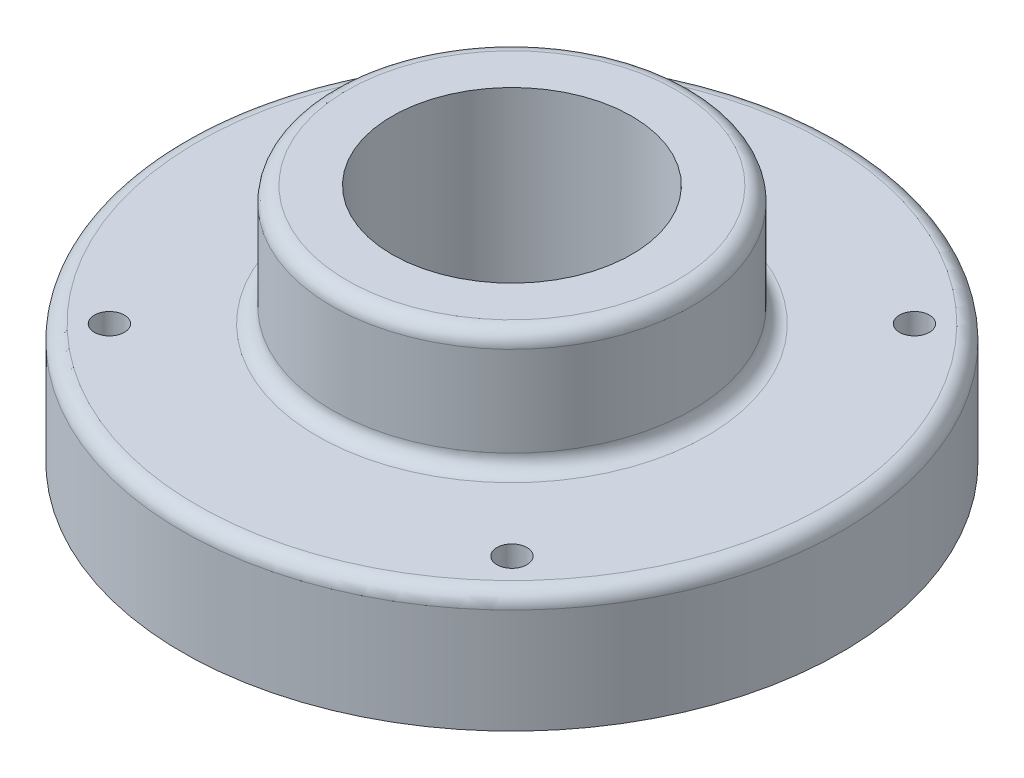
ISO-10303-21;
HEADER;
FILE_DESCRIPTION(('STEP AP214'),'2;1');
FILE_NAME('part.step','',(''),(''),'','','');
FILE_SCHEMA(('AUTOMOTIVE_DESIGN { 1 0 10303 214 1 1 1 1 }'));
ENDSEC;
DATA;
#1=APPLICATION_CONTEXT('core data for automotive mechanical design processes');
#2=APPLICATION_PROTOCOL_DEFINITION('international standard','automotive_design',2000,#1);
#3=PRODUCT_CONTEXT('',#1,'mechanical');
#4=PRODUCT('Part','Part','',(#3));
#5=PRODUCT_RELATED_PRODUCT_CATEGORY('part','',(#4));
#6=PRODUCT_DEFINITION_FORMATION('','',#4);
#7=PRODUCT_DEFINITION_CONTEXT('part definition',#1,'design');
#8=PRODUCT_DEFINITION('design','',#6,#7);
#9=PRODUCT_DEFINITION_SHAPE('','',#8);
#10=(LENGTH_UNIT() NAMED_UNIT(*) SI_UNIT(.MILLI.,.METRE.));
#11=(NAMED_UNIT(*) PLANE_ANGLE_UNIT() SI_UNIT($,.RADIAN.));
#12=(NAMED_UNIT(*) SI_UNIT($,.STERADIAN.) SOLID_ANGLE_UNIT());
#13=UNCERTAINTY_MEASURE_WITH_UNIT(LENGTH_MEASURE(1.E-05),#10,'distance_accuracy_value','');
#14=(GEOMETRIC_REPRESENTATION_CONTEXT(3) GLOBAL_UNCERTAINTY_ASSIGNED_CONTEXT((#13)) GLOBAL_UNIT_ASSIGNED_CONTEXT((#10,
#11,#12)) REPRESENTATION_CONTEXT('',''));
#15=CARTESIAN_POINT('',(0.,0.,0.));
#16=DIRECTION('',(0.,0.,1.));
#17=DIRECTION('',(1.,0.,0.));
#18=AXIS2_PLACEMENT_3D('',#15,#16,#17);
#19=CARTESIAN_POINT('',(0.,0.,0.));
#20=DIRECTION('',(0.,-1.,0.));
#21=DIRECTION('',(0.,0.,-1.));
#22=AXIS2_PLACEMENT_3D('',#19,#20,#21);
#23=CYLINDRICAL_SURFACE('',#22,12.7);
#24=CARTESIAN_POINT('',(0.,6.35,0.));
#25=DIRECTION('',(0.,-1.,0.));
#26=DIRECTION('',(0.,0.,-1.));
#27=AXIS2_PLACEMENT_3D('',#24,#25,#26);
#28=CIRCLE('',#27,12.7);
#29=CARTESIAN_POINT('',(0.,6.35,-12.7));
#30=VERTEX_POINT('',#29);
#31=EDGE_CURVE('E70',#30,#30,#28,.T.);
#32=ORIENTED_EDGE('',*,*,#31,.T.);
#33=EDGE_LOOP('',(#32));
#34=FACE_BOUND('',#33,.T.);
#35=CARTESIAN_POINT('',(0.,25.4,0.));
#36=DIRECTION('',(0.,-1.,0.));
#37=DIRECTION('',(0.,0.,-1.));
#38=AXIS2_PLACEMENT_3D('',#35,#36,#37);
#39=CIRCLE('',#38,12.7);
#40=CARTESIAN_POINT('',(0.,25.4,-12.7));
#41=VERTEX_POINT('',#40);
#42=EDGE_CURVE('E10',#41,#41,#39,.T.);
#43=ORIENTED_EDGE('',*,*,#42,.F.);
#44=EDGE_LOOP('',(#43));
#45=FACE_BOUND('',#44,.T.);
#46=ADVANCED_FACE('F30',(#34,#45),#23,.F.);
#47=CARTESIAN_POINT('',(12.7,25.4,0.));
#48=DIRECTION('',(0.,1.,0.));
#49=DIRECTION('',(0.,0.,1.));
#50=AXIS2_PLACEMENT_3D('',#47,#48,#49);
#51=PLANE('',#50);
#52=ORIENTED_EDGE('',*,*,#42,.T.);
#53=EDGE_LOOP('',(#52));
#54=FACE_BOUND('',#53,.T.);
#55=CARTESIAN_POINT('',(0.,25.4,0.));
#56=DIRECTION('',(0.,-1.,0.));
#57=DIRECTION('',(0.,0.,-1.));
#58=AXIS2_PLACEMENT_3D('',#55,#56,#57);
#59=CIRCLE('',#58,17.4625);
#60=CARTESIAN_POINT('',(0.,25.4,-17.4625));
#61=VERTEX_POINT('',#60);
#62=EDGE_CURVE('E36',#61,#61,#59,.T.);
#63=ORIENTED_EDGE('',*,*,#62,.F.);
#64=EDGE_LOOP('',(#63));
#65=FACE_BOUND('',#64,.T.);
#66=ADVANCED_FACE('F159',(#54,#65),#51,.T.);
#67=CARTESIAN_POINT('',(0.,23.8125,0.));
#68=DIRECTION('',(0.,-1.,0.));
#69=DIRECTION('',(0.,0.,-1.));
#70=AXIS2_PLACEMENT_3D('',#67,#68,#69);
#71=TOROIDAL_SURFACE('',#70,17.4625,1.5875);
#72=ORIENTED_EDGE('',*,*,#62,.T.);
#73=EDGE_LOOP('',(#72));
#74=FACE_BOUND('',#73,.T.);
#75=CARTESIAN_POINT('',(0.,23.8125,0.));
#76=DIRECTION('',(0.,-1.,0.));
#77=DIRECTION('',(0.,0.,-1.));
#78=AXIS2_PLACEMENT_3D('',#75,#76,#77);
#79=CIRCLE('',#78,19.05);
#80=CARTESIAN_POINT('',(0.,23.8125,-19.05));
#81=VERTEX_POINT('',#80);
#82=EDGE_CURVE('E40',#81,#81,#79,.T.);
#83=ORIENTED_EDGE('',*,*,#82,.F.);
#84=EDGE_LOOP('',(#83));
#85=FACE_BOUND('',#84,.T.);
#86=ADVANCED_FACE('F163',(#74,#85),#71,.T.);
#87=CARTESIAN_POINT('',(0.,0.,0.));
#88=DIRECTION('',(0.,-1.,0.));
#89=DIRECTION('',(0.,0.,-1.));
#90=AXIS2_PLACEMENT_3D('',#87,#88,#89);
#91=CYLINDRICAL_SURFACE('',#90,19.05);
#92=ORIENTED_EDGE('',*,*,#82,.T.);
#93=EDGE_LOOP('',(#92));
#94=FACE_BOUND('',#93,.T.);
#95=CARTESIAN_POINT('',(0.,14.2875,0.));
#96=DIRECTION('',(0.,-1.,0.));
#97=DIRECTION('',(0.,0.,-1.));
#98=AXIS2_PLACEMENT_3D('',#95,#96,#97);
#99=CIRCLE('',#98,19.05);
#100=CARTESIAN_POINT('',(0.,14.2875,-19.05));
#101=VERTEX_POINT('',#100);
#102=EDGE_CURVE('E44',#101,#101,#99,.T.);
#103=ORIENTED_EDGE('',*,*,#102,.F.);
#104=EDGE_LOOP('',(#103));
#105=FACE_BOUND('',#104,.T.);
#106=ADVANCED_FACE('F167',(#94,#105),#91,.T.);
#107=CARTESIAN_POINT('',(0.,14.2875,0.));
#108=DIRECTION('',(0.,-1.,0.));
#109=DIRECTION('',(0.,0.,-1.));
#110=AXIS2_PLACEMENT_3D('',#107,#108,#109);
#111=TOROIDAL_SURFACE('',#110,20.6375,1.5875);
#112=ORIENTED_EDGE('',*,*,#102,.T.);
#113=EDGE_LOOP('',(#112));
#114=FACE_BOUND('',#113,.T.);
#115=CARTESIAN_POINT('',(0.,12.7,0.));
#116=DIRECTION('',(0.,-1.,0.));
#117=DIRECTION('',(0.,0.,-1.));
#118=AXIS2_PLACEMENT_3D('',#115,#116,#117);
#119=CIRCLE('',#118,20.6375);
#120=CARTESIAN_POINT('',(0.,12.7,-20.6375));
#121=VERTEX_POINT('',#120);
#122=EDGE_CURVE('E49',#121,#121,#119,.T.);
#123=ORIENTED_EDGE('',*,*,#122,.F.);
#124=EDGE_LOOP('',(#123));
#125=FACE_BOUND('',#124,.T.);
#126=ADVANCED_FACE('F113',(#114,#125),#111,.F.);
#127=CARTESIAN_POINT('',(20.6375,12.7,0.));
#128=DIRECTION('',(0.,1.,0.));
#129=DIRECTION('',(0.,0.,1.));
#130=AXIS2_PLACEMENT_3D('',#127,#128,#129);
#131=PLANE('',#130);
#132=CARTESIAN_POINT('',(-21.3281082875393,12.7,21.3281082875391));
#133=DIRECTION('',(0.,1.,0.));
#134=DIRECTION('',(0.,0.,1.));
#135=AXIS2_PLACEMENT_3D('',#132,#133,#134);
#136=CIRCLE('',#135,1.5875);
#137=CARTESIAN_POINT('',(-21.3281082875393,12.7,22.9156082875391));
#138=VERTEX_POINT('',#137);
#139=EDGE_CURVE('E80',#138,#138,#136,.T.);
#140=ORIENTED_EDGE('',*,*,#139,.F.);
#141=EDGE_LOOP('',(#140));
#142=FACE_BOUND('',#141,.T.);
#143=CARTESIAN_POINT('',(21.3281082875391,12.7,21.3281082875393));
#144=DIRECTION('',(0.,1.,0.));
#145=DIRECTION('',(0.,0.,1.));
#146=AXIS2_PLACEMENT_3D('',#143,#144,#145);
#147=CIRCLE('',#146,1.5875);
#148=CARTESIAN_POINT('',(21.3281082875391,12.7,22.9156082875393));
#149=VERTEX_POINT('',#148);
#150=EDGE_CURVE('E86',#149,#149,#147,.T.);
#151=ORIENTED_EDGE('',*,*,#150,.F.);
#152=EDGE_LOOP('',(#151));
#153=FACE_BOUND('',#152,.T.);
#154=CARTESIAN_POINT('',(21.3281082875394,12.7,-21.3281082875391));
#155=DIRECTION('',(0.,1.,0.));
#156=DIRECTION('',(0.,0.,1.));
#157=AXIS2_PLACEMENT_3D('',#154,#155,#156);
#158=CIRCLE('',#157,1.5875);
#159=CARTESIAN_POINT('',(21.3281082875394,12.7,-19.7406082875391));
#160=VERTEX_POINT('',#159);
#161=EDGE_CURVE('E92',#160,#160,#158,.T.);
#162=ORIENTED_EDGE('',*,*,#161,.F.);
#163=EDGE_LOOP('',(#162));
#164=FACE_BOUND('',#163,.T.);
#165=CARTESIAN_POINT('',(-21.3281082875391,12.7,-21.3281082875394));
#166=DIRECTION('',(0.,1.,0.));
#167=DIRECTION('',(0.,0.,1.));
#168=AXIS2_PLACEMENT_3D('',#165,#166,#167);
#169=CIRCLE('',#168,1.58750000000001);
#170=CARTESIAN_POINT('',(-21.3281082875391,12.7,-19.7406082875393));
#171=VERTEX_POINT('',#170);
#172=EDGE_CURVE('E74',#171,#171,#169,.T.);
#173=ORIENTED_EDGE('',*,*,#172,.F.);
#174=EDGE_LOOP('',(#173));
#175=FACE_BOUND('',#174,.T.);
#176=ORIENTED_EDGE('',*,*,#122,.T.);
#177=EDGE_LOOP('',(#176));
#178=FACE_BOUND('',#177,.T.);
#179=CARTESIAN_POINT('',(0.,12.7,0.));
#180=DIRECTION('',(0.,-1.,0.));
#181=DIRECTION('',(0.,0.,-1.));
#182=AXIS2_PLACEMENT_3D('',#179,#180,#181);
#183=CIRCLE('',#182,33.3375);
#184=CARTESIAN_POINT('',(0.,12.7,-33.3375));
#185=VERTEX_POINT('',#184);
#186=EDGE_CURVE('E52',#185,#185,#183,.T.);
#187=ORIENTED_EDGE('',*,*,#186,.F.);
#188=EDGE_LOOP('',(#187));
#189=FACE_BOUND('',#188,.T.);
#190=ADVANCED_FACE('F109',(#142,#153,#164,#175,#178,#189),#131,.T.);
#191=CARTESIAN_POINT('',(0.,11.1125,0.));
#192=DIRECTION('',(0.,-1.,0.));
#193=DIRECTION('',(0.,0.,-1.));
#194=AXIS2_PLACEMENT_3D('',#191,#192,#193);
#195=TOROIDAL_SURFACE('',#194,33.3375,1.5875);
#196=ORIENTED_EDGE('',*,*,#186,.T.);
#197=EDGE_LOOP('',(#196));
#198=FACE_BOUND('',#197,.T.);
#199=CARTESIAN_POINT('',(0.,11.1125,0.));
#200=DIRECTION('',(0.,-1.,0.));
#201=DIRECTION('',(0.,0.,-1.));
#202=AXIS2_PLACEMENT_3D('',#199,#200,#201);
#203=CIRCLE('',#202,34.925);
#204=CARTESIAN_POINT('',(0.,11.1125,-34.925));
#205=VERTEX_POINT('',#204);
#206=EDGE_CURVE('E55',#205,#205,#203,.T.);
#207=ORIENTED_EDGE('',*,*,#206,.F.);
#208=EDGE_LOOP('',(#207));
#209=FACE_BOUND('',#208,.T.);
#210=ADVANCED_FACE('F112',(#198,#209),#195,.T.);
#211=CARTESIAN_POINT('',(0.,0.,0.));
#212=DIRECTION('',(0.,-1.,0.));
#213=DIRECTION('',(0.,0.,-1.));
#214=AXIS2_PLACEMENT_3D('',#211,#212,#213);
#215=CYLINDRICAL_SURFACE('',#214,34.925);
#216=ORIENTED_EDGE('',*,*,#206,.T.);
#217=EDGE_LOOP('',(#216));
#218=FACE_BOUND('',#217,.T.);
#219=CARTESIAN_POINT('',(0.,0.,0.));
#220=DIRECTION('',(0.,-1.,0.));
#221=DIRECTION('',(0.,0.,-1.));
#222=AXIS2_PLACEMENT_3D('',#219,#220,#221);
#223=CIRCLE('',#222,34.925);
#224=CARTESIAN_POINT('',(0.,0.,-34.925));
#225=VERTEX_POINT('',#224);
#226=EDGE_CURVE('E58',#225,#225,#223,.T.);
#227=ORIENTED_EDGE('',*,*,#226,.F.);
#228=EDGE_LOOP('',(#227));
#229=FACE_BOUND('',#228,.T.);
#230=ADVANCED_FACE('F124',(#218,#229),#215,.T.);
#231=CARTESIAN_POINT('',(34.925,0.,0.));
#232=DIRECTION('',(0.,-1.,0.));
#233=DIRECTION('',(0.,0.,-1.));
#234=AXIS2_PLACEMENT_3D('',#231,#232,#233);
#235=PLANE('',#234);
#236=CARTESIAN_POINT('',(-21.3281082875393,0.,21.3281082875391));
#237=DIRECTION('',(0.,1.,0.));
#238=DIRECTION('',(0.,0.,1.));
#239=AXIS2_PLACEMENT_3D('',#236,#237,#238);
#240=CIRCLE('',#239,1.5875);
#241=CARTESIAN_POINT('',(-21.3281082875393,0.,22.9156082875391));
#242=VERTEX_POINT('',#241);
#243=EDGE_CURVE('E83',#242,#242,#240,.T.);
#244=ORIENTED_EDGE('',*,*,#243,.T.);
#245=EDGE_LOOP('',(#244));
#246=FACE_BOUND('',#245,.T.);
#247=CARTESIAN_POINT('',(21.3281082875391,0.,21.3281082875393));
#248=DIRECTION('',(0.,1.,0.));
#249=DIRECTION('',(0.,0.,1.));
#250=AXIS2_PLACEMENT_3D('',#247,#248,#249);
#251=CIRCLE('',#250,1.5875);
#252=CARTESIAN_POINT('',(21.3281082875391,0.,22.9156082875393));
#253=VERTEX_POINT('',#252);
#254=EDGE_CURVE('E89',#253,#253,#251,.T.);
#255=ORIENTED_EDGE('',*,*,#254,.T.);
#256=EDGE_LOOP('',(#255));
#257=FACE_BOUND('',#256,.T.);
#258=CARTESIAN_POINT('',(21.3281082875394,0.,-21.3281082875391));
#259=DIRECTION('',(0.,1.,0.));
#260=DIRECTION('',(0.,0.,1.));
#261=AXIS2_PLACEMENT_3D('',#258,#259,#260);
#262=CIRCLE('',#261,1.5875);
#263=CARTESIAN_POINT('',(21.3281082875394,0.,-19.7406082875391));
#264=VERTEX_POINT('',#263);
#265=EDGE_CURVE('E77',#264,#264,#262,.T.);
#266=ORIENTED_EDGE('',*,*,#265,.T.);
#267=EDGE_LOOP('',(#266));
#268=FACE_BOUND('',#267,.T.);
#269=CARTESIAN_POINT('',(-21.3281082875391,0.,-21.3281082875394));
#270=DIRECTION('',(0.,1.,0.));
#271=DIRECTION('',(0.,0.,1.));
#272=AXIS2_PLACEMENT_3D('',#269,#270,#271);
#273=CIRCLE('',#272,1.58750000000001);
#274=CARTESIAN_POINT('',(-21.3281082875391,0.,-19.7406082875393));
#275=VERTEX_POINT('',#274);
#276=EDGE_CURVE('E73',#275,#275,#273,.T.);
#277=ORIENTED_EDGE('',*,*,#276,.T.);
#278=EDGE_LOOP('',(#277));
#279=FACE_BOUND('',#278,.T.);
#280=ORIENTED_EDGE('',*,*,#226,.T.);
#281=EDGE_LOOP('',(#280));
#282=FACE_BOUND('',#281,.T.);
#283=CARTESIAN_POINT('',(0.,0.,0.));
#284=DIRECTION('',(0.,-1.,0.));
#285=DIRECTION('',(0.,0.,-1.));
#286=AXIS2_PLACEMENT_3D('',#283,#284,#285);
#287=CIRCLE('',#286,25.4);
#288=CARTESIAN_POINT('',(0.,0.,-25.4));
#289=VERTEX_POINT('',#288);
#290=EDGE_CURVE('E61',#289,#289,#287,.T.);
#291=ORIENTED_EDGE('',*,*,#290,.F.);
#292=EDGE_LOOP('',(#291));
#293=FACE_BOUND('',#292,.T.);
#294=ADVANCED_FACE('F98',(#246,#257,#268,#279,#282,#293),#235,.T.);
#295=CARTESIAN_POINT('',(0.,0.,0.));
#296=DIRECTION('',(0.,-1.,0.));
#297=DIRECTION('',(0.,0.,-1.));
#298=AXIS2_PLACEMENT_3D('',#295,#296,#297);
#299=CYLINDRICAL_SURFACE('',#298,25.4);
#300=ORIENTED_EDGE('',*,*,#290,.T.);
#301=EDGE_LOOP('',(#300));
#302=FACE_BOUND('',#301,.T.);
#303=CARTESIAN_POINT('',(0.,3.17499999999998,0.));
#304=DIRECTION('',(0.,-1.,0.));
#305=DIRECTION('',(0.,0.,-1.));
#306=AXIS2_PLACEMENT_3D('',#303,#304,#305);
#307=CIRCLE('',#306,25.4);
#308=CARTESIAN_POINT('',(0.,3.17499999999998,-25.4));
#309=VERTEX_POINT('',#308);
#310=EDGE_CURVE('E64',#309,#309,#307,.T.);
#311=ORIENTED_EDGE('',*,*,#310,.F.);
#312=EDGE_LOOP('',(#311));
#313=FACE_BOUND('',#312,.T.);
#314=ADVANCED_FACE('F135',(#302,#313),#299,.F.);
#315=CARTESIAN_POINT('',(0.,3.175,0.));
#316=DIRECTION('',(0.,-1.,0.));
#317=DIRECTION('',(0.,0.,-1.));
#318=AXIS2_PLACEMENT_3D('',#315,#316,#317);
#319=TOROIDAL_SURFACE('',#318,22.225,3.175);
#320=ORIENTED_EDGE('',*,*,#310,.T.);
#321=EDGE_LOOP('',(#320));
#322=FACE_BOUND('',#321,.T.);
#323=CARTESIAN_POINT('',(0.,6.35,0.));
#324=DIRECTION('',(0.,-1.,0.));
#325=DIRECTION('',(0.,0.,-1.));
#326=AXIS2_PLACEMENT_3D('',#323,#324,#325);
#327=CIRCLE('',#326,22.225);
#328=CARTESIAN_POINT('',(0.,6.35,-22.225));
#329=VERTEX_POINT('',#328);
#330=EDGE_CURVE('E67',#329,#329,#327,.T.);
#331=ORIENTED_EDGE('',*,*,#330,.F.);
#332=EDGE_LOOP('',(#331));
#333=FACE_BOUND('',#332,.T.);
#334=ADVANCED_FACE('F142',(#322,#333),#319,.F.);
#335=CARTESIAN_POINT('',(22.225,6.35,0.));
#336=DIRECTION('',(0.,-1.,0.));
#337=DIRECTION('',(0.,0.,-1.));
#338=AXIS2_PLACEMENT_3D('',#335,#336,#337);
#339=PLANE('',#338);
#340=ORIENTED_EDGE('',*,*,#330,.T.);
#341=EDGE_LOOP('',(#340));
#342=FACE_BOUND('',#341,.T.);
#343=ORIENTED_EDGE('',*,*,#31,.F.);
#344=EDGE_LOOP('',(#343));
#345=FACE_BOUND('',#344,.T.);
#346=ADVANCED_FACE('F148',(#342,#345),#339,.T.);
#347=CARTESIAN_POINT('',(-21.3281082875391,0.,-21.3281082875394));
#348=DIRECTION('',(0.,1.,0.));
#349=DIRECTION('',(0.,0.,1.));
#350=AXIS2_PLACEMENT_3D('',#347,#348,#349);
#351=CYLINDRICAL_SURFACE('',#350,1.58750000000001);
#352=ORIENTED_EDGE('',*,*,#276,.F.);
#353=EDGE_LOOP('',(#352));
#354=FACE_BOUND('',#353,.T.);
#355=ORIENTED_EDGE('',*,*,#172,.T.);
#356=EDGE_LOOP('',(#355));
#357=FACE_BOUND('',#356,.T.);
#358=ADVANCED_FACE('F105',(#354,#357),#351,.F.);
#359=CARTESIAN_POINT('',(21.3281082875394,0.,-21.3281082875391));
#360=DIRECTION('',(0.,1.,0.));
#361=DIRECTION('',(0.,0.,1.));
#362=AXIS2_PLACEMENT_3D('',#359,#360,#361);
#363=CYLINDRICAL_SURFACE('',#362,1.5875);
#364=ORIENTED_EDGE('',*,*,#265,.F.);
#365=EDGE_LOOP('',(#364));
#366=FACE_BOUND('',#365,.T.);
#367=ORIENTED_EDGE('',*,*,#161,.T.);
#368=EDGE_LOOP('',(#367));
#369=FACE_BOUND('',#368,.T.);
#370=ADVANCED_FACE('F101',(#366,#369),#363,.F.);
#371=CARTESIAN_POINT('',(21.3281082875391,0.,21.3281082875393));
#372=DIRECTION('',(0.,1.,0.));
#373=DIRECTION('',(0.,0.,1.));
#374=AXIS2_PLACEMENT_3D('',#371,#372,#373);
#375=CYLINDRICAL_SURFACE('',#374,1.5875);
#376=ORIENTED_EDGE('',*,*,#254,.F.);
#377=EDGE_LOOP('',(#376));
#378=FACE_BOUND('',#377,.T.);
#379=ORIENTED_EDGE('',*,*,#150,.T.);
#380=EDGE_LOOP('',(#379));
#381=FACE_BOUND('',#380,.T.);
#382=ADVANCED_FACE('F104',(#378,#381),#375,.F.);
#383=CARTESIAN_POINT('',(-21.3281082875393,0.,21.3281082875391));
#384=DIRECTION('',(0.,1.,0.));
#385=DIRECTION('',(0.,0.,1.));
#386=AXIS2_PLACEMENT_3D('',#383,#384,#385);
#387=CYLINDRICAL_SURFACE('',#386,1.5875);
#388=ORIENTED_EDGE('',*,*,#243,.F.);
#389=EDGE_LOOP('',(#388));
#390=FACE_BOUND('',#389,.T.);
#391=ORIENTED_EDGE('',*,*,#139,.T.);
#392=EDGE_LOOP('',(#391));
#393=FACE_BOUND('',#392,.T.);
#394=ADVANCED_FACE('F180',(#390,#393),#387,.F.);
#395=CLOSED_SHELL('',(#46,#66,#86,#106,#126,#190,#210,#230,#294,#314,#334,#346,#358,#370,#382,#394));
#396=MANIFOLD_SOLID_BREP('B2',#395);
#397=ADVANCED_BREP_SHAPE_REPRESENTATION('',(#18,#396),#14);
#398=SHAPE_DEFINITION_REPRESENTATION(#9,#397);
ENDSEC;
END-ISO-10303-21;
